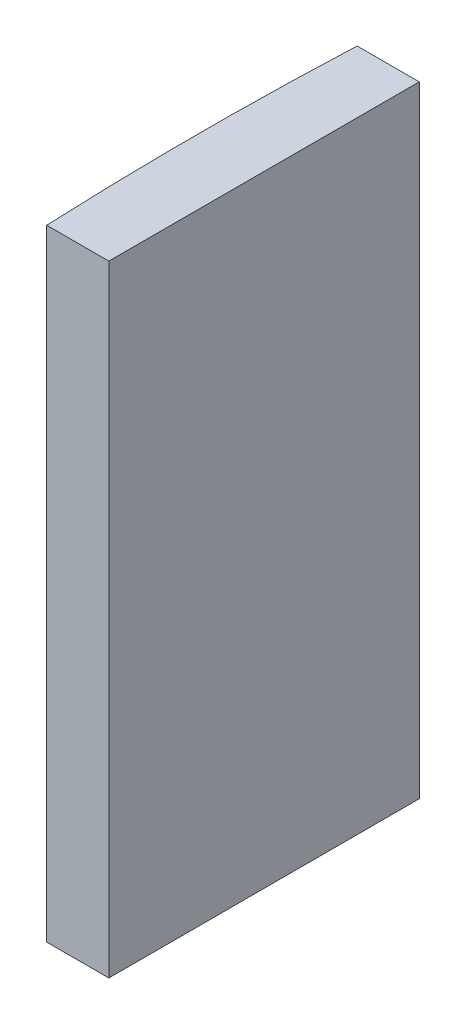
ISO-10303-21;
HEADER;
FILE_DESCRIPTION(('STEP AP214'),'2;1');
FILE_NAME('part.step','',(''),(''),'','','');
FILE_SCHEMA(('AUTOMOTIVE_DESIGN { 1 0 10303 214 1 1 1 1 }'));
ENDSEC;
DATA;
#1=APPLICATION_CONTEXT('core data for automotive mechanical design processes');
#2=APPLICATION_PROTOCOL_DEFINITION('international standard','automotive_design',2000,#1);
#3=PRODUCT_CONTEXT('',#1,'mechanical');
#4=PRODUCT('Part','Part','',(#3));
#5=PRODUCT_RELATED_PRODUCT_CATEGORY('part','',(#4));
#6=PRODUCT_DEFINITION_FORMATION('','',#4);
#7=PRODUCT_DEFINITION_CONTEXT('part definition',#1,'design');
#8=PRODUCT_DEFINITION('design','',#6,#7);
#9=PRODUCT_DEFINITION_SHAPE('','',#8);
#10=(LENGTH_UNIT() NAMED_UNIT(*) SI_UNIT(.MILLI.,.METRE.));
#11=(NAMED_UNIT(*) PLANE_ANGLE_UNIT() SI_UNIT($,.RADIAN.));
#12=(NAMED_UNIT(*) SI_UNIT($,.STERADIAN.) SOLID_ANGLE_UNIT());
#13=UNCERTAINTY_MEASURE_WITH_UNIT(LENGTH_MEASURE(1.E-05),#10,'distance_accuracy_value','');
#14=(GEOMETRIC_REPRESENTATION_CONTEXT(3) GLOBAL_UNCERTAINTY_ASSIGNED_CONTEXT((#13)) GLOBAL_UNIT_ASSIGNED_CONTEXT((#10,
#11,#12)) REPRESENTATION_CONTEXT('',''));
#15=CARTESIAN_POINT('',(0.,0.,0.));
#16=DIRECTION('',(0.,0.,1.));
#17=DIRECTION('',(1.,0.,0.));
#18=AXIS2_PLACEMENT_3D('',#15,#16,#17);
#19=CARTESIAN_POINT('',(4.35520433485127,20.,0.));
#20=DIRECTION('',(0.,-1.,0.));
#21=DIRECTION('',(0.,0.,-1.));
#22=AXIS2_PLACEMENT_3D('',#19,#20,#21);
#23=CYLINDRICAL_SURFACE('',#22,114.62);
#24=CARTESIAN_POINT('',(4.35520433485127,0.,0.));
#25=DIRECTION('',(0.,1.,0.));
#26=DIRECTION('',(0.,0.,1.));
#27=AXIS2_PLACEMENT_3D('',#24,#25,#26);
#28=CIRCLE('',#27,114.62);
#29=CARTESIAN_POINT('',(-110.155687723503,0.,-5.));
#30=VERTEX_POINT('',#29);
#31=CARTESIAN_POINT('',(-110.155687723503,0.,5.));
#32=VERTEX_POINT('',#31);
#33=EDGE_CURVE('E100',#30,#32,#28,.T.);
#34=ORIENTED_EDGE('',*,*,#33,.T.);
#35=DIRECTION('',(0.,-1.,0.));
#36=VECTOR('',#35,1.);
#37=CARTESIAN_POINT('',(-110.155687723503,20.,5.));
#38=LINE('',#37,#36);
#39=CARTESIAN_POINT('',(-110.155687723503,20.,5.));
#40=VERTEX_POINT('',#39);
#41=EDGE_CURVE('E11',#40,#32,#38,.T.);
#42=ORIENTED_EDGE('',*,*,#41,.F.);
#43=CARTESIAN_POINT('',(4.35520433485127,20.,0.));
#44=DIRECTION('',(0.,1.,0.));
#45=DIRECTION('',(0.,0.,1.));
#46=AXIS2_PLACEMENT_3D('',#43,#44,#45);
#47=CIRCLE('',#46,114.62);
#48=CARTESIAN_POINT('',(-110.155687723503,20.,-5.));
#49=VERTEX_POINT('',#48);
#50=EDGE_CURVE('E88',#49,#40,#47,.T.);
#51=ORIENTED_EDGE('',*,*,#50,.F.);
#52=DIRECTION('',(0.,-1.,0.));
#53=VECTOR('',#52,1.);
#54=CARTESIAN_POINT('',(-110.155687723503,20.,-5.));
#55=LINE('',#54,#53);
#56=EDGE_CURVE('E96',#49,#30,#55,.T.);
#57=ORIENTED_EDGE('',*,*,#56,.T.);
#58=EDGE_LOOP('',(#34,#42,#51,#57));
#59=FACE_BOUND('',#58,.T.);
#60=ADVANCED_FACE('F37',(#59),#23,.T.);
#61=CARTESIAN_POINT('',(-110.155687723503,20.,5.));
#62=DIRECTION('',(0.,0.,-1.));
#63=DIRECTION('',(-1.,0.,0.));
#64=AXIS2_PLACEMENT_3D('',#61,#62,#63);
#65=PLANE('',#64);
#66=DIRECTION('',(1.,0.,0.));
#67=VECTOR('',#66,1.);
#68=CARTESIAN_POINT('',(-110.155687723503,0.,5.));
#69=LINE('',#68,#67);
#70=CARTESIAN_POINT('',(-108.154795665149,0.,5.));
#71=VERTEX_POINT('',#70);
#72=EDGE_CURVE('E92',#32,#71,#69,.T.);
#73=ORIENTED_EDGE('',*,*,#72,.T.);
#74=DIRECTION('',(0.,-1.,0.));
#75=VECTOR('',#74,1.);
#76=CARTESIAN_POINT('',(-108.154795665149,20.,5.));
#77=LINE('',#76,#75);
#78=CARTESIAN_POINT('',(-108.154795665149,20.,5.));
#79=VERTEX_POINT('',#78);
#80=EDGE_CURVE('E45',#79,#71,#77,.T.);
#81=ORIENTED_EDGE('',*,*,#80,.F.);
#82=DIRECTION('',(1.,0.,0.));
#83=VECTOR('',#82,1.);
#84=CARTESIAN_POINT('',(-110.155687723503,20.,5.));
#85=LINE('',#84,#83);
#86=EDGE_CURVE('E83',#40,#79,#85,.T.);
#87=ORIENTED_EDGE('',*,*,#86,.F.);
#88=ORIENTED_EDGE('',*,*,#41,.T.);
#89=EDGE_LOOP('',(#73,#81,#87,#88));
#90=FACE_BOUND('',#89,.T.);
#91=ADVANCED_FACE('F91',(#90),#65,.F.);
#92=CARTESIAN_POINT('',(-108.154795665149,20.,-5.));
#93=DIRECTION('',(-1.,0.,0.));
#94=DIRECTION('',(0.,0.,1.));
#95=AXIS2_PLACEMENT_3D('',#92,#93,#94);
#96=PLANE('',#95);
#97=DIRECTION('',(0.,0.,-1.));
#98=VECTOR('',#97,1.);
#99=CARTESIAN_POINT('',(-108.154795665149,0.,-5.));
#100=LINE('',#99,#98);
#101=CARTESIAN_POINT('',(-108.154795665149,0.,-5.));
#102=VERTEX_POINT('',#101);
#103=EDGE_CURVE('E70',#71,#102,#100,.T.);
#104=ORIENTED_EDGE('',*,*,#103,.T.);
#105=DIRECTION('',(0.,-1.,0.));
#106=VECTOR('',#105,1.);
#107=CARTESIAN_POINT('',(-108.154795665149,20.,-5.));
#108=LINE('',#107,#106);
#109=CARTESIAN_POINT('',(-108.154795665149,20.,-5.));
#110=VERTEX_POINT('',#109);
#111=EDGE_CURVE('E93',#110,#102,#108,.T.);
#112=ORIENTED_EDGE('',*,*,#111,.F.);
#113=DIRECTION('',(0.,0.,-1.));
#114=VECTOR('',#113,1.);
#115=CARTESIAN_POINT('',(-108.154795665149,20.,-5.));
#116=LINE('',#115,#114);
#117=EDGE_CURVE('E86',#79,#110,#116,.T.);
#118=ORIENTED_EDGE('',*,*,#117,.F.);
#119=ORIENTED_EDGE('',*,*,#80,.T.);
#120=EDGE_LOOP('',(#104,#112,#118,#119));
#121=FACE_BOUND('',#120,.T.);
#122=ADVANCED_FACE('F94',(#121),#96,.F.);
#123=CARTESIAN_POINT('',(-110.155687723503,20.,-5.));
#124=DIRECTION('',(0.,0.,1.));
#125=DIRECTION('',(1.,0.,0.));
#126=AXIS2_PLACEMENT_3D('',#123,#124,#125);
#127=PLANE('',#126);
#128=DIRECTION('',(-1.,0.,0.));
#129=VECTOR('',#128,1.);
#130=CARTESIAN_POINT('',(-110.155687723503,0.,-5.));
#131=LINE('',#130,#129);
#132=EDGE_CURVE('E76',#102,#30,#131,.T.);
#133=ORIENTED_EDGE('',*,*,#132,.T.);
#134=ORIENTED_EDGE('',*,*,#56,.F.);
#135=DIRECTION('',(-1.,0.,0.));
#136=VECTOR('',#135,1.);
#137=CARTESIAN_POINT('',(-110.155687723503,20.,-5.));
#138=LINE('',#137,#136);
#139=EDGE_CURVE('E53',#110,#49,#138,.T.);
#140=ORIENTED_EDGE('',*,*,#139,.F.);
#141=ORIENTED_EDGE('',*,*,#111,.T.);
#142=EDGE_LOOP('',(#133,#134,#140,#141));
#143=FACE_BOUND('',#142,.T.);
#144=ADVANCED_FACE('F107',(#143),#127,.F.);
#145=CARTESIAN_POINT('',(4.35520433485127,20.,0.));
#146=DIRECTION('',(0.,1.,0.));
#147=DIRECTION('',(0.,0.,1.));
#148=AXIS2_PLACEMENT_3D('',#145,#146,#147);
#149=PLANE('',#148);
#150=ORIENTED_EDGE('',*,*,#50,.T.);
#151=ORIENTED_EDGE('',*,*,#86,.T.);
#152=ORIENTED_EDGE('',*,*,#117,.T.);
#153=ORIENTED_EDGE('',*,*,#139,.T.);
#154=EDGE_LOOP('',(#150,#151,#152,#153));
#155=FACE_BOUND('',#154,.T.);
#156=ADVANCED_FACE('F84',(#155),#149,.T.);
#157=CARTESIAN_POINT('',(4.35520433485127,0.,0.));
#158=DIRECTION('',(0.,1.,0.));
#159=DIRECTION('',(0.,0.,1.));
#160=AXIS2_PLACEMENT_3D('',#157,#158,#159);
#161=PLANE('',#160);
#162=ORIENTED_EDGE('',*,*,#33,.F.);
#163=ORIENTED_EDGE('',*,*,#132,.F.);
#164=ORIENTED_EDGE('',*,*,#103,.F.);
#165=ORIENTED_EDGE('',*,*,#72,.F.);
#166=EDGE_LOOP('',(#162,#163,#164,#165));
#167=FACE_BOUND('',#166,.T.);
#168=ADVANCED_FACE('F110',(#167),#161,.F.);
#169=CLOSED_SHELL('',(#60,#91,#122,#144,#156,#168));
#170=MANIFOLD_SOLID_BREP('B2',#169);
#171=ADVANCED_BREP_SHAPE_REPRESENTATION('',(#18,#170),#14);
#172=SHAPE_DEFINITION_REPRESENTATION(#9,#171);
ENDSEC;
END-ISO-10303-21;
